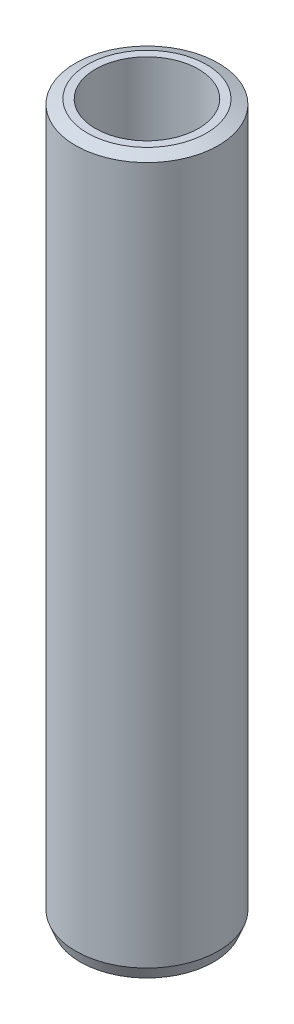
ISO-10303-21;
HEADER;
FILE_DESCRIPTION(('STEP AP214'),'2;1');
FILE_NAME('part.step','',(''),(''),'','','');
FILE_SCHEMA(('AUTOMOTIVE_DESIGN { 1 0 10303 214 1 1 1 1 }'));
ENDSEC;
DATA;
#1=APPLICATION_CONTEXT('core data for automotive mechanical design processes');
#2=APPLICATION_PROTOCOL_DEFINITION('international standard','automotive_design',2000,#1);
#3=PRODUCT_CONTEXT('',#1,'mechanical');
#4=PRODUCT('Part','Part','',(#3));
#5=PRODUCT_RELATED_PRODUCT_CATEGORY('part','',(#4));
#6=PRODUCT_DEFINITION_FORMATION('','',#4);
#7=PRODUCT_DEFINITION_CONTEXT('part definition',#1,'design');
#8=PRODUCT_DEFINITION('design','',#6,#7);
#9=PRODUCT_DEFINITION_SHAPE('','',#8);
#10=(LENGTH_UNIT() NAMED_UNIT(*) SI_UNIT(.MILLI.,.METRE.));
#11=(NAMED_UNIT(*) PLANE_ANGLE_UNIT() SI_UNIT($,.RADIAN.));
#12=(NAMED_UNIT(*) SI_UNIT($,.STERADIAN.) SOLID_ANGLE_UNIT());
#13=UNCERTAINTY_MEASURE_WITH_UNIT(LENGTH_MEASURE(1.E-05),#10,'distance_accuracy_value','');
#14=(GEOMETRIC_REPRESENTATION_CONTEXT(3) GLOBAL_UNCERTAINTY_ASSIGNED_CONTEXT((#13)) GLOBAL_UNIT_ASSIGNED_CONTEXT((#10,
#11,#12)) REPRESENTATION_CONTEXT('',''));
#15=CARTESIAN_POINT('',(0.,0.,0.));
#16=DIRECTION('',(0.,0.,1.));
#17=DIRECTION('',(1.,0.,0.));
#18=AXIS2_PLACEMENT_3D('',#15,#16,#17);
#19=CARTESIAN_POINT('',(0.,600.,0.));
#20=DIRECTION('',(0.,-1.,0.));
#21=DIRECTION('',(0.,0.,-1.));
#22=AXIS2_PLACEMENT_3D('',#19,#20,#21);
#23=CYLINDRICAL_SURFACE('',#22,60.);
#24=CARTESIAN_POINT('',(0.,596.007266033261,0.));
#25=DIRECTION('',(0.,1.,0.));
#26=DIRECTION('',(0.,0.,1.));
#27=AXIS2_PLACEMENT_3D('',#24,#25,#26);
#28=CIRCLE('',#27,60.);
#29=CARTESIAN_POINT('',(0.,596.007266033261,60.));
#30=VERTEX_POINT('',#29);
#31=EDGE_CURVE('E50',#30,#30,#28,.F.);
#32=ORIENTED_EDGE('',*,*,#31,.T.);
#33=EDGE_LOOP('',(#32));
#34=FACE_BOUND('',#33,.T.);
#35=CARTESIAN_POINT('',(0.,10.0396213988838,0.));
#36=DIRECTION('',(0.,1.,0.));
#37=DIRECTION('',(0.,0.,1.));
#38=AXIS2_PLACEMENT_3D('',#35,#36,#37);
#39=CIRCLE('',#38,60.);
#40=CARTESIAN_POINT('',(0.,10.0396213988838,60.));
#41=VERTEX_POINT('',#40);
#42=EDGE_CURVE('E51',#41,#41,#39,.T.);
#43=ORIENTED_EDGE('',*,*,#42,.T.);
#44=EDGE_LOOP('',(#43));
#45=FACE_BOUND('',#44,.T.);
#46=ADVANCED_FACE('F39',(#34,#45),#23,.T.);
#47=CARTESIAN_POINT('',(0.,600.,0.));
#48=DIRECTION('',(0.,1.,0.));
#49=DIRECTION('',(0.,0.,1.));
#50=AXIS2_PLACEMENT_3D('',#47,#48,#49);
#51=PLANE('',#50);
#52=CARTESIAN_POINT('',(0.,600.,0.));
#53=DIRECTION('',(0.,1.,0.));
#54=DIRECTION('',(0.,0.,1.));
#55=AXIS2_PLACEMENT_3D('',#52,#53,#54);
#56=CIRCLE('',#55,49.9603786011168);
#57=CARTESIAN_POINT('',(0.,600.,49.9603786011168));
#58=VERTEX_POINT('',#57);
#59=EDGE_CURVE('E54',#58,#58,#56,.T.);
#60=ORIENTED_EDGE('',*,*,#59,.T.);
#61=EDGE_LOOP('',(#60));
#62=FACE_BOUND('',#61,.T.);
#63=CARTESIAN_POINT('',(0.,600.,0.));
#64=DIRECTION('',(0.,1.,0.));
#65=DIRECTION('',(0.,0.,1.));
#66=AXIS2_PLACEMENT_3D('',#63,#64,#65);
#67=CIRCLE('',#66,43.2552801252371);
#68=CARTESIAN_POINT('',(0.,600.,43.2552801252371));
#69=VERTEX_POINT('',#68);
#70=EDGE_CURVE('E58',#69,#69,#67,.T.);
#71=ORIENTED_EDGE('',*,*,#70,.F.);
#72=EDGE_LOOP('',(#71));
#73=FACE_BOUND('',#72,.T.);
#74=ADVANCED_FACE('F69',(#62,#73),#51,.T.);
#75=CARTESIAN_POINT('',(0.,0.,0.));
#76=DIRECTION('',(0.,1.,0.));
#77=DIRECTION('',(0.,0.,1.));
#78=AXIS2_PLACEMENT_3D('',#75,#76,#77);
#79=PLANE('',#78);
#80=CARTESIAN_POINT('',(0.,0.,0.));
#81=DIRECTION('',(0.,1.,0.));
#82=DIRECTION('',(0.,0.,1.));
#83=AXIS2_PLACEMENT_3D('',#80,#81,#82);
#84=CIRCLE('',#83,56.0072660332603);
#85=CARTESIAN_POINT('',(0.,0.,56.0072660332603));
#86=VERTEX_POINT('',#85);
#87=EDGE_CURVE('E10',#86,#86,#84,.F.);
#88=ORIENTED_EDGE('',*,*,#87,.T.);
#89=EDGE_LOOP('',(#88));
#90=FACE_BOUND('',#89,.T.);
#91=CARTESIAN_POINT('',(0.,0.,0.));
#92=DIRECTION('',(0.,1.,0.));
#93=DIRECTION('',(0.,0.,1.));
#94=AXIS2_PLACEMENT_3D('',#91,#92,#93);
#95=CIRCLE('',#94,43.2552801252371);
#96=CARTESIAN_POINT('',(0.,0.,43.2552801252371));
#97=VERTEX_POINT('',#96);
#98=EDGE_CURVE('E63',#97,#97,#95,.T.);
#99=ORIENTED_EDGE('',*,*,#98,.T.);
#100=EDGE_LOOP('',(#99));
#101=FACE_BOUND('',#100,.T.);
#102=ADVANCED_FACE('F75',(#90,#101),#79,.F.);
#103=CARTESIAN_POINT('',(0.,600.,0.));
#104=DIRECTION('',(0.,-1.,0.));
#105=DIRECTION('',(0.,0.,-1.));
#106=AXIS2_PLACEMENT_3D('',#103,#104,#105);
#107=CYLINDRICAL_SURFACE('',#106,43.2552801252371);
#108=ORIENTED_EDGE('',*,*,#70,.T.);
#109=EDGE_LOOP('',(#108));
#110=FACE_BOUND('',#109,.T.);
#111=ORIENTED_EDGE('',*,*,#98,.F.);
#112=EDGE_LOOP('',(#111));
#113=FACE_BOUND('',#112,.T.);
#114=ADVANCED_FACE('F70',(#110,#113),#107,.F.);
#115=CARTESIAN_POINT('',(0.,600.,0.));
#116=DIRECTION('',(0.,-1.,0.));
#117=DIRECTION('',(0.,0.,-1.));
#118=AXIS2_PLACEMENT_3D('',#115,#116,#117);
#119=CONICAL_SURFACE('',#118,49.9603786011168,1.19227629741403);
#120=ORIENTED_EDGE('',*,*,#31,.F.);
#121=EDGE_LOOP('',(#120));
#122=FACE_BOUND('',#121,.T.);
#123=ORIENTED_EDGE('',*,*,#59,.F.);
#124=EDGE_LOOP('',(#123));
#125=FACE_BOUND('',#124,.T.);
#126=ADVANCED_FACE('F81',(#122,#125),#119,.T.);
#127=CARTESIAN_POINT('',(0.,10.0396213988838,0.));
#128=DIRECTION('',(0.,1.,0.));
#129=DIRECTION('',(0.,0.,1.));
#130=AXIS2_PLACEMENT_3D('',#127,#128,#129);
#131=CONICAL_SURFACE('',#130,60.,0.378520029380867);
#132=ORIENTED_EDGE('',*,*,#87,.F.);
#133=EDGE_LOOP('',(#132));
#134=FACE_BOUND('',#133,.T.);
#135=ORIENTED_EDGE('',*,*,#42,.F.);
#136=EDGE_LOOP('',(#135));
#137=FACE_BOUND('',#136,.T.);
#138=ADVANCED_FACE('F45',(#134,#137),#131,.T.);
#139=CLOSED_SHELL('',(#46,#74,#102,#114,#126,#138));
#140=MANIFOLD_SOLID_BREP('B2',#139);
#141=ADVANCED_BREP_SHAPE_REPRESENTATION('',(#18,#140),#14);
#142=SHAPE_DEFINITION_REPRESENTATION(#9,#141);
ENDSEC;
END-ISO-10303-21;
